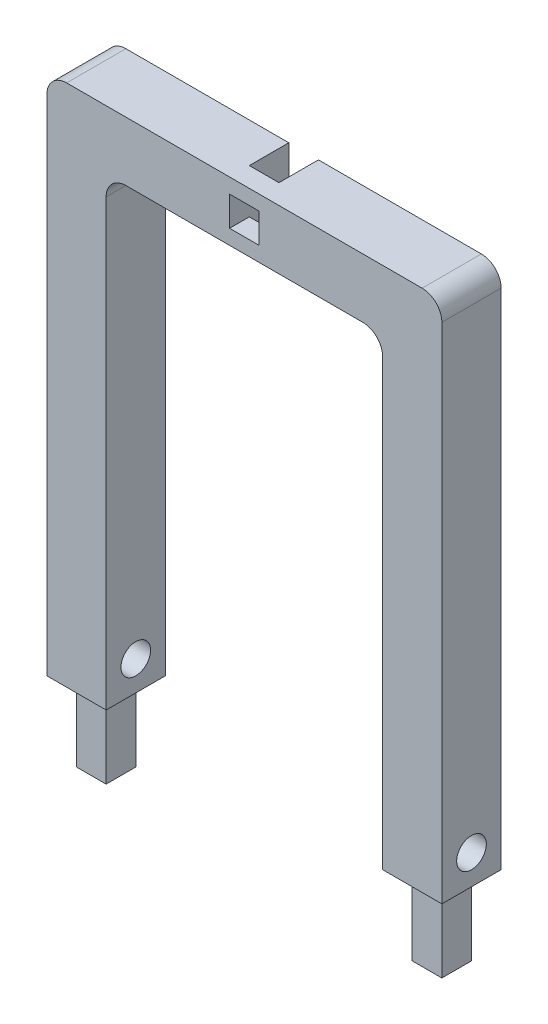
ISO-10303-21;
HEADER;
FILE_DESCRIPTION(('STEP AP214'),'2;1');
FILE_NAME('part.step','',(''),(''),'','','');
FILE_SCHEMA(('AUTOMOTIVE_DESIGN { 1 0 10303 214 1 1 1 1 }'));
ENDSEC;
DATA;
#1=APPLICATION_CONTEXT('core data for automotive mechanical design processes');
#2=APPLICATION_PROTOCOL_DEFINITION('international standard','automotive_design',2000,#1);
#3=PRODUCT_CONTEXT('',#1,'mechanical');
#4=PRODUCT('Part','Part','',(#3));
#5=PRODUCT_RELATED_PRODUCT_CATEGORY('part','',(#4));
#6=PRODUCT_DEFINITION_FORMATION('','',#4);
#7=PRODUCT_DEFINITION_CONTEXT('part definition',#1,'design');
#8=PRODUCT_DEFINITION('design','',#6,#7);
#9=PRODUCT_DEFINITION_SHAPE('','',#8);
#10=(LENGTH_UNIT() NAMED_UNIT(*) SI_UNIT(.MILLI.,.METRE.));
#11=(NAMED_UNIT(*) PLANE_ANGLE_UNIT() SI_UNIT($,.RADIAN.));
#12=(NAMED_UNIT(*) SI_UNIT($,.STERADIAN.) SOLID_ANGLE_UNIT());
#13=UNCERTAINTY_MEASURE_WITH_UNIT(LENGTH_MEASURE(1.E-05),#10,'distance_accuracy_value','');
#14=(GEOMETRIC_REPRESENTATION_CONTEXT(3) GLOBAL_UNCERTAINTY_ASSIGNED_CONTEXT((#13)) GLOBAL_UNIT_ASSIGNED_CONTEXT((#10,
#11,#12)) REPRESENTATION_CONTEXT('',''));
#15=CARTESIAN_POINT('',(0.,0.,0.));
#16=DIRECTION('',(0.,0.,1.));
#17=DIRECTION('',(1.,0.,0.));
#18=AXIS2_PLACEMENT_3D('',#15,#16,#17);
#19=CARTESIAN_POINT('',(0.,0.,19.9999999999999));
#20=DIRECTION('',(0.,0.,1.));
#21=DIRECTION('',(1.,0.,0.));
#22=AXIS2_PLACEMENT_3D('',#19,#20,#21);
#23=PLANE('',#22);
#24=DIRECTION('',(0.,-1.,0.));
#25=VECTOR('',#24,1.);
#26=CARTESIAN_POINT('',(-0.430867489218175,147.118199142858,19.9999999999999));
#27=LINE('',#26,#25);
#28=CARTESIAN_POINT('',(-0.43086748921817,177.118199142858,19.9999999999999));
#29=VERTEX_POINT('',#28);
#30=CARTESIAN_POINT('',(-0.43086748921817,169.618199142858,20.));
#31=VERTEX_POINT('',#30);
#32=EDGE_CURVE('E474',#29,#31,#27,.T.);
#33=ORIENTED_EDGE('',*,*,#32,.T.);
#34=DIRECTION('',(-1.,0.,0.));
#35=VECTOR('',#34,1.);
#36=CARTESIAN_POINT('',(-15.4308674892182,169.618199142858,20.));
#37=LINE('',#36,#35);
#38=CARTESIAN_POINT('',(-15.4308674892182,169.618199142858,20.));
#39=VERTEX_POINT('',#38);
#40=EDGE_CURVE('E229',#31,#39,#37,.T.);
#41=ORIENTED_EDGE('',*,*,#40,.T.);
#42=DIRECTION('',(0.,1.,0.));
#43=VECTOR('',#42,1.);
#44=CARTESIAN_POINT('',(-15.4308674892182,147.118199142858,19.9999999999999));
#45=LINE('',#44,#43);
#46=CARTESIAN_POINT('',(-15.4308674892182,177.118199142858,19.9999999999999));
#47=VERTEX_POINT('',#46);
#48=EDGE_CURVE('E242',#39,#47,#45,.T.);
#49=ORIENTED_EDGE('',*,*,#48,.T.);
#50=DIRECTION('',(1.,0.,0.));
#51=VECTOR('',#50,1.);
#52=CARTESIAN_POINT('',(-0.43086748921817,177.118199142858,19.9999999999999));
#53=LINE('',#52,#51);
#54=EDGE_CURVE('E241',#47,#29,#53,.T.);
#55=ORIENTED_EDGE('',*,*,#54,.T.);
#56=EDGE_LOOP('',(#33,#41,#49,#55));
#57=FACE_BOUND('',#56,.T.);
#58=ADVANCED_FACE('F41',(#57),#23,.F.);
#59=CARTESIAN_POINT('',(0.,0.,0.));
#60=DIRECTION('',(0.,0.,-1.));
#61=DIRECTION('',(-1.,0.,0.));
#62=AXIS2_PLACEMENT_3D('',#59,#60,#61);
#63=PLANE('',#62);
#64=DIRECTION('',(0.,-1.,0.));
#65=VECTOR('',#64,1.);
#66=CARTESIAN_POINT('',(-0.430867489218175,147.118199142858,0.));
#67=LINE('',#66,#65);
#68=CARTESIAN_POINT('',(-0.43086748921817,177.118199142858,0.));
#69=VERTEX_POINT('',#68);
#70=CARTESIAN_POINT('',(-0.430867489218175,147.118199142858,0.));
#71=VERTEX_POINT('',#70);
#72=EDGE_CURVE('E250',#69,#71,#67,.T.);
#73=ORIENTED_EDGE('',*,*,#72,.F.);
#74=DIRECTION('',(-1.,0.,0.));
#75=VECTOR('',#74,1.);
#76=CARTESIAN_POINT('',(-107.931034482759,177.118199142858,0.));
#77=LINE('',#76,#75);
#78=CARTESIAN_POINT('',(82.0689655172413,177.118199142858,0.));
#79=VERTEX_POINT('',#78);
#80=EDGE_CURVE('E347',#79,#69,#77,.T.);
#81=ORIENTED_EDGE('',*,*,#80,.F.);
#82=CARTESIAN_POINT('',(82.0689655172413,167.118199142858,0.));
#83=DIRECTION('',(0.,0.,-1.));
#84=DIRECTION('',(-1.,0.,0.));
#85=AXIS2_PLACEMENT_3D('',#82,#83,#84);
#86=CIRCLE('',#85,10.);
#87=CARTESIAN_POINT('',(92.0689655172413,167.118199142858,0.));
#88=VERTEX_POINT('',#87);
#89=EDGE_CURVE('E419',#79,#88,#86,.T.);
#90=ORIENTED_EDGE('',*,*,#89,.T.);
#91=DIRECTION('',(0.,1.,0.));
#92=VECTOR('',#91,1.);
#93=CARTESIAN_POINT('',(92.0689655172413,177.118199142858,0.));
#94=LINE('',#93,#92);
#95=CARTESIAN_POINT('',(92.0689655172414,-87.8818008571423,0.));
#96=VERTEX_POINT('',#95);
#97=EDGE_CURVE('E380',#96,#88,#94,.T.);
#98=ORIENTED_EDGE('',*,*,#97,.F.);
#99=DIRECTION('',(1.,0.,0.));
#100=VECTOR('',#99,1.);
#101=CARTESIAN_POINT('',(92.0689655172414,-87.8818008571423,0.));
#102=LINE('',#101,#100);
#103=CARTESIAN_POINT('',(62.0689655172414,-87.8818008571423,0.));
#104=VERTEX_POINT('',#103);
#105=EDGE_CURVE('E378',#104,#96,#102,.T.);
#106=ORIENTED_EDGE('',*,*,#105,.F.);
#107=DIRECTION('',(0.,-1.,0.));
#108=VECTOR('',#107,1.);
#109=CARTESIAN_POINT('',(62.0689655172414,-87.8818008571423,0.));
#110=LINE('',#109,#108);
#111=CARTESIAN_POINT('',(62.0689655172414,137.118199142858,0.));
#112=VERTEX_POINT('',#111);
#113=EDGE_CURVE('E376',#112,#104,#110,.T.);
#114=ORIENTED_EDGE('',*,*,#113,.F.);
#115=CARTESIAN_POINT('',(52.0689655172414,137.118199142858,0.));
#116=DIRECTION('',(0.,0.,-1.));
#117=DIRECTION('',(-1.,0.,0.));
#118=AXIS2_PLACEMENT_3D('',#115,#116,#117);
#119=CIRCLE('',#118,10.);
#120=CARTESIAN_POINT('',(52.0689655172414,147.118199142858,0.));
#121=VERTEX_POINT('',#120);
#122=EDGE_CURVE('E407',#112,#121,#119,.F.);
#123=ORIENTED_EDGE('',*,*,#122,.T.);
#124=DIRECTION('',(1.,0.,0.));
#125=VECTOR('',#124,1.);
#126=CARTESIAN_POINT('',(62.0689655172414,147.118199142858,0.));
#127=LINE('',#126,#125);
#128=EDGE_CURVE('E372',#71,#121,#127,.T.);
#129=ORIENTED_EDGE('',*,*,#128,.F.);
#130=EDGE_LOOP('',(#73,#81,#90,#98,#106,#114,#123,#129));
#131=FACE_BOUND('',#130,.T.);
#132=ADVANCED_FACE('F500',(#131),#63,.T.);
#133=CARTESIAN_POINT('',(-77.9310344827586,-87.8818008571423,30.));
#134=DIRECTION('',(0.,1.,0.));
#135=DIRECTION('',(0.,0.,1.));
#136=AXIS2_PLACEMENT_3D('',#133,#134,#135);
#137=PLANE('',#136);
#138=DIRECTION('',(1.,0.,0.));
#139=VECTOR('',#138,1.);
#140=CARTESIAN_POINT('',(-77.9310344827586,-87.8818008571423,0.));
#141=LINE('',#140,#139);
#142=CARTESIAN_POINT('',(-107.931034482759,-87.8818008571423,0.));
#143=VERTEX_POINT('',#142);
#144=CARTESIAN_POINT('',(-77.9310344827586,-87.8818008571423,0.));
#145=VERTEX_POINT('',#144);
#146=EDGE_CURVE('E367',#143,#145,#141,.T.);
#147=ORIENTED_EDGE('',*,*,#146,.T.);
#148=DIRECTION('',(0.,0.,-1.));
#149=VECTOR('',#148,1.);
#150=CARTESIAN_POINT('',(-77.9310344827586,-87.8818008571423,30.));
#151=LINE('',#150,#149);
#152=CARTESIAN_POINT('',(-77.9310344827586,-87.8818008571423,30.));
#153=VERTEX_POINT('',#152);
#154=EDGE_CURVE('E391',#153,#145,#151,.T.);
#155=ORIENTED_EDGE('',*,*,#154,.F.);
#156=DIRECTION('',(1.,0.,0.));
#157=VECTOR('',#156,1.);
#158=CARTESIAN_POINT('',(-77.9310344827586,-87.8818008571423,30.));
#159=LINE('',#158,#157);
#160=CARTESIAN_POINT('',(-107.931034482759,-87.8818008571423,30.));
#161=VERTEX_POINT('',#160);
#162=EDGE_CURVE('E346',#161,#153,#159,.T.);
#163=ORIENTED_EDGE('',*,*,#162,.F.);
#164=DIRECTION('',(0.,0.,-1.));
#165=VECTOR('',#164,1.);
#166=CARTESIAN_POINT('',(-107.931034482759,-87.8818008571423,30.));
#167=LINE('',#166,#165);
#168=EDGE_CURVE('E394',#161,#143,#167,.T.);
#169=ORIENTED_EDGE('',*,*,#168,.T.);
#170=EDGE_LOOP('',(#147,#155,#163,#169));
#171=FACE_BOUND('',#170,.T.);
#172=DIRECTION('',(0.,0.,1.));
#173=VECTOR('',#172,1.);
#174=CARTESIAN_POINT('',(-85.4310344827586,-87.8818008571424,22.5));
#175=LINE('',#174,#173);
#176=CARTESIAN_POINT('',(-85.4310344827586,-87.8818008571424,7.5));
#177=VERTEX_POINT('',#176);
#178=CARTESIAN_POINT('',(-85.4310344827586,-87.8818008571423,22.5));
#179=VERTEX_POINT('',#178);
#180=EDGE_CURVE('E277',#177,#179,#175,.T.);
#181=ORIENTED_EDGE('',*,*,#180,.F.);
#182=DIRECTION('',(1.,0.,0.));
#183=VECTOR('',#182,1.);
#184=CARTESIAN_POINT('',(-100.431034482759,-87.8818008571424,7.5));
#185=LINE('',#184,#183);
#186=CARTESIAN_POINT('',(-100.431034482759,-87.8818008571423,7.5));
#187=VERTEX_POINT('',#186);
#188=EDGE_CURVE('E282',#187,#177,#185,.T.);
#189=ORIENTED_EDGE('',*,*,#188,.F.);
#190=DIRECTION('',(0.,0.,-1.));
#191=VECTOR('',#190,1.);
#192=CARTESIAN_POINT('',(-100.431034482759,-87.8818008571424,22.5));
#193=LINE('',#192,#191);
#194=CARTESIAN_POINT('',(-100.431034482759,-87.8818008571423,22.5));
#195=VERTEX_POINT('',#194);
#196=EDGE_CURVE('E294',#195,#187,#193,.T.);
#197=ORIENTED_EDGE('',*,*,#196,.F.);
#198=DIRECTION('',(-1.,0.,0.));
#199=VECTOR('',#198,1.);
#200=CARTESIAN_POINT('',(-100.431034482759,-87.8818008571424,22.5));
#201=LINE('',#200,#199);
#202=EDGE_CURVE('E291',#179,#195,#201,.T.);
#203=ORIENTED_EDGE('',*,*,#202,.F.);
#204=EDGE_LOOP('',(#181,#189,#197,#203));
#205=FACE_BOUND('',#204,.T.);
#206=ADVANCED_FACE('F452',(#171,#205),#137,.F.);
#207=CARTESIAN_POINT('',(92.0689655172414,-87.8818008571423,30.));
#208=DIRECTION('',(0.,1.,0.));
#209=DIRECTION('',(-1.,0.,0.));
#210=AXIS2_PLACEMENT_3D('',#207,#208,#209);
#211=PLANE('',#210);
#212=ORIENTED_EDGE('',*,*,#105,.T.);
#213=DIRECTION('',(0.,0.,-1.));
#214=VECTOR('',#213,1.);
#215=CARTESIAN_POINT('',(92.0689655172414,-87.8818008571423,30.));
#216=LINE('',#215,#214);
#217=CARTESIAN_POINT('',(92.0689655172414,-87.8818008571423,30.));
#218=VERTEX_POINT('',#217);
#219=EDGE_CURVE('E365',#218,#96,#216,.T.);
#220=ORIENTED_EDGE('',*,*,#219,.F.);
#221=DIRECTION('',(1.,0.,0.));
#222=VECTOR('',#221,1.);
#223=CARTESIAN_POINT('',(92.0689655172414,-87.8818008571423,30.));
#224=LINE('',#223,#222);
#225=CARTESIAN_POINT('',(62.0689655172414,-87.8818008571423,30.));
#226=VERTEX_POINT('',#225);
#227=EDGE_CURVE('E357',#226,#218,#224,.T.);
#228=ORIENTED_EDGE('',*,*,#227,.F.);
#229=DIRECTION('',(0.,0.,-1.));
#230=VECTOR('',#229,1.);
#231=CARTESIAN_POINT('',(62.0689655172414,-87.8818008571423,30.));
#232=LINE('',#231,#230);
#233=EDGE_CURVE('E388',#226,#104,#232,.T.);
#234=ORIENTED_EDGE('',*,*,#233,.T.);
#235=EDGE_LOOP('',(#212,#220,#228,#234));
#236=FACE_BOUND('',#235,.T.);
#237=DIRECTION('',(0.,0.,1.));
#238=VECTOR('',#237,1.);
#239=CARTESIAN_POINT('',(84.5689655172413,-87.8818008571423,22.5));
#240=LINE('',#239,#238);
#241=CARTESIAN_POINT('',(84.5689655172413,-87.8818008571423,7.5));
#242=VERTEX_POINT('',#241);
#243=CARTESIAN_POINT('',(84.5689655172414,-87.8818008571423,22.5));
#244=VERTEX_POINT('',#243);
#245=EDGE_CURVE('E310',#242,#244,#240,.T.);
#246=ORIENTED_EDGE('',*,*,#245,.F.);
#247=DIRECTION('',(1.,0.,0.));
#248=VECTOR('',#247,1.);
#249=CARTESIAN_POINT('',(69.5689655172413,-87.8818008571423,7.5));
#250=LINE('',#249,#248);
#251=CARTESIAN_POINT('',(69.5689655172413,-87.8818008571423,7.5));
#252=VERTEX_POINT('',#251);
#253=EDGE_CURVE('E315',#252,#242,#250,.T.);
#254=ORIENTED_EDGE('',*,*,#253,.F.);
#255=DIRECTION('',(0.,0.,-1.));
#256=VECTOR('',#255,1.);
#257=CARTESIAN_POINT('',(69.5689655172413,-87.8818008571423,22.5));
#258=LINE('',#257,#256);
#259=CARTESIAN_POINT('',(69.5689655172413,-87.8818008571423,22.5));
#260=VERTEX_POINT('',#259);
#261=EDGE_CURVE('E327',#260,#252,#258,.T.);
#262=ORIENTED_EDGE('',*,*,#261,.F.);
#263=DIRECTION('',(-1.,0.,0.));
#264=VECTOR('',#263,1.);
#265=CARTESIAN_POINT('',(69.5689655172413,-87.8818008571423,22.5));
#266=LINE('',#265,#264);
#267=EDGE_CURVE('E324',#244,#260,#266,.T.);
#268=ORIENTED_EDGE('',*,*,#267,.F.);
#269=EDGE_LOOP('',(#246,#254,#262,#268));
#270=FACE_BOUND('',#269,.T.);
#271=ADVANCED_FACE('F516',(#236,#270),#211,.F.);
#272=CARTESIAN_POINT('',(-107.931034482759,-87.8818008571423,30.));
#273=DIRECTION('',(1.,0.,0.));
#274=DIRECTION('',(0.,0.,-1.));
#275=AXIS2_PLACEMENT_3D('',#272,#273,#274);
#276=PLANE('',#275);
#277=CARTESIAN_POINT('',(-107.931034482759,-72.8818008571423,15.));
#278=DIRECTION('',(1.,0.,0.));
#279=DIRECTION('',(0.,1.,0.));
#280=AXIS2_PLACEMENT_3D('',#277,#278,#279);
#281=CIRCLE('',#280,7.50000000000001);
#282=CARTESIAN_POINT('',(-107.931034482759,-65.3818008571423,15.));
#283=VERTEX_POINT('',#282);
#284=EDGE_CURVE('E268',#283,#283,#281,.T.);
#285=ORIENTED_EDGE('',*,*,#284,.T.);
#286=EDGE_LOOP('',(#285));
#287=FACE_BOUND('',#286,.T.);
#288=DIRECTION('',(0.,-1.,0.));
#289=VECTOR('',#288,1.);
#290=CARTESIAN_POINT('',(-107.931034482759,-87.8818008571423,30.));
#291=LINE('',#290,#289);
#292=CARTESIAN_POINT('',(-107.931034482759,167.118199142858,30.));
#293=VERTEX_POINT('',#292);
#294=EDGE_CURVE('E344',#293,#161,#291,.T.);
#295=ORIENTED_EDGE('',*,*,#294,.F.);
#296=DIRECTION('',(0.,0.,-1.));
#297=VECTOR('',#296,1.);
#298=CARTESIAN_POINT('',(-107.931034482759,167.118199142858,30.));
#299=LINE('',#298,#297);
#300=CARTESIAN_POINT('',(-107.931034482759,167.118199142858,0.));
#301=VERTEX_POINT('',#300);
#302=EDGE_CURVE('E416',#293,#301,#299,.T.);
#303=ORIENTED_EDGE('',*,*,#302,.T.);
#304=DIRECTION('',(0.,-1.,0.));
#305=VECTOR('',#304,1.);
#306=CARTESIAN_POINT('',(-107.931034482759,-87.8818008571423,0.));
#307=LINE('',#306,#305);
#308=EDGE_CURVE('E343',#301,#143,#307,.T.);
#309=ORIENTED_EDGE('',*,*,#308,.T.);
#310=ORIENTED_EDGE('',*,*,#168,.F.);
#311=EDGE_LOOP('',(#295,#303,#309,#310));
#312=FACE_BOUND('',#311,.T.);
#313=ADVANCED_FACE('F441',(#287,#312),#276,.F.);
#314=CARTESIAN_POINT('',(-77.9310344827587,147.118199142858,30.));
#315=DIRECTION('',(-1.,0.,0.));
#316=DIRECTION('',(0.,-1.,0.));
#317=AXIS2_PLACEMENT_3D('',#314,#315,#316);
#318=PLANE('',#317);
#319=CARTESIAN_POINT('',(-77.9310344827586,-72.8818008571423,15.));
#320=DIRECTION('',(-1.,0.,0.));
#321=DIRECTION('',(0.,-1.,0.));
#322=AXIS2_PLACEMENT_3D('',#319,#320,#321);
#323=CIRCLE('',#322,7.50000000000001);
#324=CARTESIAN_POINT('',(-77.9310344827586,-80.3818008571423,15.));
#325=VERTEX_POINT('',#324);
#326=EDGE_CURVE('E274',#325,#325,#323,.T.);
#327=ORIENTED_EDGE('',*,*,#326,.T.);
#328=EDGE_LOOP('',(#327));
#329=FACE_BOUND('',#328,.T.);
#330=DIRECTION('',(0.,1.,0.));
#331=VECTOR('',#330,1.);
#332=CARTESIAN_POINT('',(-77.9310344827587,147.118199142858,0.));
#333=LINE('',#332,#331);
#334=CARTESIAN_POINT('',(-77.9310344827587,137.118199142858,0.));
#335=VERTEX_POINT('',#334);
#336=EDGE_CURVE('E369',#145,#335,#333,.T.);
#337=ORIENTED_EDGE('',*,*,#336,.T.);
#338=DIRECTION('',(0.,0.,-1.));
#339=VECTOR('',#338,1.);
#340=CARTESIAN_POINT('',(-77.9310344827587,137.118199142858,30.));
#341=LINE('',#340,#339);
#342=CARTESIAN_POINT('',(-77.9310344827587,137.118199142858,30.));
#343=VERTEX_POINT('',#342);
#344=EDGE_CURVE('E405',#335,#343,#341,.F.);
#345=ORIENTED_EDGE('',*,*,#344,.T.);
#346=DIRECTION('',(0.,1.,0.));
#347=VECTOR('',#346,1.);
#348=CARTESIAN_POINT('',(-77.9310344827587,147.118199142858,30.));
#349=LINE('',#348,#347);
#350=EDGE_CURVE('E349',#153,#343,#349,.T.);
#351=ORIENTED_EDGE('',*,*,#350,.F.);
#352=ORIENTED_EDGE('',*,*,#154,.T.);
#353=EDGE_LOOP('',(#337,#345,#351,#352));
#354=FACE_BOUND('',#353,.T.);
#355=ADVANCED_FACE('F739',(#329,#354),#318,.F.);
#356=CARTESIAN_POINT('',(62.0689655172414,147.118199142858,30.));
#357=DIRECTION('',(0.,1.,0.));
#358=DIRECTION('',(0.,0.,1.));
#359=AXIS2_PLACEMENT_3D('',#356,#357,#358);
#360=PLANE('',#359);
#361=DIRECTION('',(-1.,0.,0.));
#362=VECTOR('',#361,1.);
#363=CARTESIAN_POINT('',(-0.430867489218175,147.118199142858,19.9999999999999));
#364=LINE('',#363,#362);
#365=CARTESIAN_POINT('',(-0.430867489218175,147.118199142858,19.9999999999999));
#366=VERTEX_POINT('',#365);
#367=CARTESIAN_POINT('',(-15.4308674892182,147.118199142858,19.9999999999999));
#368=VERTEX_POINT('',#367);
#369=EDGE_CURVE('E239',#366,#368,#364,.T.);
#370=ORIENTED_EDGE('',*,*,#369,.F.);
#371=DIRECTION('',(0.,0.,-1.));
#372=VECTOR('',#371,1.);
#373=CARTESIAN_POINT('',(-0.430867489218175,147.118199142858,19.9999999999999));
#374=LINE('',#373,#372);
#375=EDGE_CURVE('E245',#366,#71,#374,.T.);
#376=ORIENTED_EDGE('',*,*,#375,.T.);
#377=ORIENTED_EDGE('',*,*,#128,.T.);
#378=DIRECTION('',(0.,0.,-1.));
#379=VECTOR('',#378,1.);
#380=CARTESIAN_POINT('',(52.0689655172414,147.118199142858,30.));
#381=LINE('',#380,#379);
#382=CARTESIAN_POINT('',(52.0689655172414,147.118199142858,30.));
#383=VERTEX_POINT('',#382);
#384=EDGE_CURVE('E403',#121,#383,#381,.F.);
#385=ORIENTED_EDGE('',*,*,#384,.T.);
#386=DIRECTION('',(1.,0.,0.));
#387=VECTOR('',#386,1.);
#388=CARTESIAN_POINT('',(62.0689655172414,147.118199142858,30.));
#389=LINE('',#388,#387);
#390=CARTESIAN_POINT('',(-67.9310344827586,147.118199142858,30.));
#391=VERTEX_POINT('',#390);
#392=EDGE_CURVE('E352',#391,#383,#389,.T.);
#393=ORIENTED_EDGE('',*,*,#392,.F.);
#394=DIRECTION('',(0.,0.,-1.));
#395=VECTOR('',#394,1.);
#396=CARTESIAN_POINT('',(-67.9310344827586,147.118199142858,0.));
#397=LINE('',#396,#395);
#398=CARTESIAN_POINT('',(-67.9310344827586,147.118199142858,0.));
#399=VERTEX_POINT('',#398);
#400=EDGE_CURVE('E400',#391,#399,#397,.T.);
#401=ORIENTED_EDGE('',*,*,#400,.T.);
#402=CARTESIAN_POINT('',(-15.4308674892182,147.118199142858,0.));
#403=VERTEX_POINT('',#402);
#404=EDGE_CURVE('E373',#399,#403,#127,.T.);
#405=ORIENTED_EDGE('',*,*,#404,.T.);
#406=DIRECTION('',(0.,0.,-1.));
#407=VECTOR('',#406,1.);
#408=CARTESIAN_POINT('',(-15.4308674892182,147.118199142858,19.9999999999999));
#409=LINE('',#408,#407);
#410=EDGE_CURVE('E262',#368,#403,#409,.T.);
#411=ORIENTED_EDGE('',*,*,#410,.F.);
#412=EDGE_LOOP('',(#370,#376,#377,#385,#393,#401,#405,#411));
#413=FACE_BOUND('',#412,.T.);
#414=ADVANCED_FACE('F464',(#413),#360,.F.);
#415=CARTESIAN_POINT('',(62.0689655172414,-87.8818008571423,30.));
#416=DIRECTION('',(1.,0.,0.));
#417=DIRECTION('',(0.,0.,-1.));
#418=AXIS2_PLACEMENT_3D('',#415,#416,#417);
#419=PLANE('',#418);
#420=CARTESIAN_POINT('',(62.0689655172413,-72.8818008571423,15.));
#421=DIRECTION('',(1.,0.,0.));
#422=DIRECTION('',(0.,0.,-1.));
#423=AXIS2_PLACEMENT_3D('',#420,#421,#422);
#424=CIRCLE('',#423,7.50000000000001);
#425=CARTESIAN_POINT('',(62.0689655172413,-72.8818008571423,7.49999999999999));
#426=VERTEX_POINT('',#425);
#427=EDGE_CURVE('E271',#426,#426,#424,.T.);
#428=ORIENTED_EDGE('',*,*,#427,.T.);
#429=EDGE_LOOP('',(#428));
#430=FACE_BOUND('',#429,.T.);
#431=DIRECTION('',(0.,-1.,0.));
#432=VECTOR('',#431,1.);
#433=CARTESIAN_POINT('',(62.0689655172414,-87.8818008571423,30.));
#434=LINE('',#433,#432);
#435=CARTESIAN_POINT('',(62.0689655172414,137.118199142858,30.));
#436=VERTEX_POINT('',#435);
#437=EDGE_CURVE('E355',#436,#226,#434,.T.);
#438=ORIENTED_EDGE('',*,*,#437,.F.);
#439=DIRECTION('',(0.,0.,-1.));
#440=VECTOR('',#439,1.);
#441=CARTESIAN_POINT('',(62.0689655172414,137.118199142858,0.));
#442=LINE('',#441,#440);
#443=EDGE_CURVE('E397',#436,#112,#442,.T.);
#444=ORIENTED_EDGE('',*,*,#443,.T.);
#445=ORIENTED_EDGE('',*,*,#113,.T.);
#446=ORIENTED_EDGE('',*,*,#233,.F.);
#447=EDGE_LOOP('',(#438,#444,#445,#446));
#448=FACE_BOUND('',#447,.T.);
#449=ADVANCED_FACE('F512',(#430,#448),#419,.F.);
#450=CARTESIAN_POINT('',(92.0689655172413,177.118199142858,30.));
#451=DIRECTION('',(-1.,0.,0.));
#452=DIRECTION('',(0.,-1.,0.));
#453=AXIS2_PLACEMENT_3D('',#450,#451,#452);
#454=PLANE('',#453);
#455=CARTESIAN_POINT('',(92.0689655172414,-72.8818008571423,15.));
#456=DIRECTION('',(1.,0.,0.));
#457=DIRECTION('',(0.,1.,0.));
#458=AXIS2_PLACEMENT_3D('',#455,#456,#457);
#459=CIRCLE('',#458,7.50000000000001);
#460=CARTESIAN_POINT('',(92.0689655172414,-65.3818008571423,15.));
#461=VERTEX_POINT('',#460);
#462=EDGE_CURVE('E258',#461,#461,#459,.T.);
#463=ORIENTED_EDGE('',*,*,#462,.F.);
#464=EDGE_LOOP('',(#463));
#465=FACE_BOUND('',#464,.T.);
#466=ORIENTED_EDGE('',*,*,#97,.T.);
#467=DIRECTION('',(0.,0.,-1.));
#468=VECTOR('',#467,1.);
#469=CARTESIAN_POINT('',(92.0689655172413,167.118199142858,30.));
#470=LINE('',#469,#468);
#471=CARTESIAN_POINT('',(92.0689655172413,167.118199142858,30.));
#472=VERTEX_POINT('',#471);
#473=EDGE_CURVE('E11',#88,#472,#470,.F.);
#474=ORIENTED_EDGE('',*,*,#473,.T.);
#475=DIRECTION('',(0.,1.,0.));
#476=VECTOR('',#475,1.);
#477=CARTESIAN_POINT('',(92.0689655172413,177.118199142858,30.));
#478=LINE('',#477,#476);
#479=EDGE_CURVE('E359',#218,#472,#478,.T.);
#480=ORIENTED_EDGE('',*,*,#479,.F.);
#481=ORIENTED_EDGE('',*,*,#219,.T.);
#482=EDGE_LOOP('',(#466,#474,#480,#481));
#483=FACE_BOUND('',#482,.T.);
#484=ADVANCED_FACE('F525',(#465,#483),#454,.F.);
#485=CARTESIAN_POINT('',(-107.931034482759,177.118199142858,30.));
#486=DIRECTION('',(0.,-1.,0.));
#487=DIRECTION('',(0.,0.,-1.));
#488=AXIS2_PLACEMENT_3D('',#485,#486,#487);
#489=PLANE('',#488);
#490=ORIENTED_EDGE('',*,*,#80,.T.);
#491=DIRECTION('',(0.,0.,-1.));
#492=VECTOR('',#491,1.);
#493=CARTESIAN_POINT('',(-0.43086748921817,177.118199142858,19.9999999999999));
#494=LINE('',#493,#492);
#495=EDGE_CURVE('E256',#29,#69,#494,.T.);
#496=ORIENTED_EDGE('',*,*,#495,.F.);
#497=ORIENTED_EDGE('',*,*,#54,.F.);
#498=DIRECTION('',(0.,0.,-1.));
#499=VECTOR('',#498,1.);
#500=CARTESIAN_POINT('',(-15.4308674892182,177.118199142858,19.9999999999999));
#501=LINE('',#500,#499);
#502=CARTESIAN_POINT('',(-15.4308674892182,177.118199142858,0.));
#503=VERTEX_POINT('',#502);
#504=EDGE_CURVE('E259',#47,#503,#501,.T.);
#505=ORIENTED_EDGE('',*,*,#504,.T.);
#506=CARTESIAN_POINT('',(-97.9310344827586,177.118199142858,0.));
#507=VERTEX_POINT('',#506);
#508=EDGE_CURVE('E383',#503,#507,#77,.T.);
#509=ORIENTED_EDGE('',*,*,#508,.T.);
#510=DIRECTION('',(0.,0.,-1.));
#511=VECTOR('',#510,1.);
#512=CARTESIAN_POINT('',(-97.9310344827586,177.118199142858,30.));
#513=LINE('',#512,#511);
#514=CARTESIAN_POINT('',(-97.9310344827586,177.118199142858,30.));
#515=VERTEX_POINT('',#514);
#516=EDGE_CURVE('E427',#507,#515,#513,.F.);
#517=ORIENTED_EDGE('',*,*,#516,.T.);
#518=DIRECTION('',(-1.,0.,0.));
#519=VECTOR('',#518,1.);
#520=CARTESIAN_POINT('',(-107.931034482759,177.118199142858,30.));
#521=LINE('',#520,#519);
#522=CARTESIAN_POINT('',(82.0689655172413,177.118199142858,30.));
#523=VERTEX_POINT('',#522);
#524=EDGE_CURVE('E362',#523,#515,#521,.T.);
#525=ORIENTED_EDGE('',*,*,#524,.F.);
#526=DIRECTION('',(0.,0.,-1.));
#527=VECTOR('',#526,1.);
#528=CARTESIAN_POINT('',(82.0689655172413,177.118199142858,30.));
#529=LINE('',#528,#527);
#530=EDGE_CURVE('E424',#523,#79,#529,.T.);
#531=ORIENTED_EDGE('',*,*,#530,.T.);
#532=EDGE_LOOP('',(#490,#496,#497,#505,#509,#517,#525,#531));
#533=FACE_BOUND('',#532,.T.);
#534=ADVANCED_FACE('F469',(#533),#489,.F.);
#535=CARTESIAN_POINT('',(0.,0.,30.));
#536=DIRECTION('',(0.,0.,-1.));
#537=DIRECTION('',(-1.,0.,0.));
#538=AXIS2_PLACEMENT_3D('',#535,#536,#537);
#539=PLANE('',#538);
#540=DIRECTION('',(1.,0.,0.));
#541=VECTOR('',#540,1.);
#542=CARTESIAN_POINT('',(-15.4308674892182,154.618199142858,30.));
#543=LINE('',#542,#541);
#544=CARTESIAN_POINT('',(-15.4308674892182,154.618199142858,30.));
#545=VERTEX_POINT('',#544);
#546=CARTESIAN_POINT('',(-0.43086748921817,154.618199142858,30.));
#547=VERTEX_POINT('',#546);
#548=EDGE_CURVE('E487',#545,#547,#543,.T.);
#549=ORIENTED_EDGE('',*,*,#548,.F.);
#550=DIRECTION('',(0.,-1.,0.));
#551=VECTOR('',#550,1.);
#552=CARTESIAN_POINT('',(-15.4308674892182,169.618199142858,30.));
#553=LINE('',#552,#551);
#554=CARTESIAN_POINT('',(-15.4308674892182,169.618199142858,30.));
#555=VERTEX_POINT('',#554);
#556=EDGE_CURVE('E56',#555,#545,#553,.T.);
#557=ORIENTED_EDGE('',*,*,#556,.F.);
#558=DIRECTION('',(-1.,0.,0.));
#559=VECTOR('',#558,1.);
#560=CARTESIAN_POINT('',(-15.4308674892182,169.618199142858,30.));
#561=LINE('',#560,#559);
#562=CARTESIAN_POINT('',(-0.43086748921817,169.618199142858,30.));
#563=VERTEX_POINT('',#562);
#564=EDGE_CURVE('E235',#563,#555,#561,.T.);
#565=ORIENTED_EDGE('',*,*,#564,.F.);
#566=DIRECTION('',(0.,1.,0.));
#567=VECTOR('',#566,1.);
#568=CARTESIAN_POINT('',(-0.43086748921817,169.618199142858,30.));
#569=LINE('',#568,#567);
#570=EDGE_CURVE('E485',#547,#563,#569,.T.);
#571=ORIENTED_EDGE('',*,*,#570,.F.);
#572=EDGE_LOOP('',(#549,#557,#565,#571));
#573=FACE_BOUND('',#572,.T.);
#574=ORIENTED_EDGE('',*,*,#524,.T.);
#575=CARTESIAN_POINT('',(-97.9310344827586,167.118199142858,30.));
#576=DIRECTION('',(0.,0.,-1.));
#577=DIRECTION('',(-1.,0.,0.));
#578=AXIS2_PLACEMENT_3D('',#575,#576,#577);
#579=CIRCLE('',#578,10.);
#580=EDGE_CURVE('E49',#515,#293,#579,.F.);
#581=ORIENTED_EDGE('',*,*,#580,.T.);
#582=ORIENTED_EDGE('',*,*,#294,.T.);
#583=ORIENTED_EDGE('',*,*,#162,.T.);
#584=ORIENTED_EDGE('',*,*,#350,.T.);
#585=CARTESIAN_POINT('',(-67.9310344827586,137.118199142858,30.));
#586=DIRECTION('',(0.,0.,-1.));
#587=DIRECTION('',(-1.,0.,0.));
#588=AXIS2_PLACEMENT_3D('',#585,#586,#587);
#589=CIRCLE('',#588,10.);
#590=EDGE_CURVE('E414',#343,#391,#589,.T.);
#591=ORIENTED_EDGE('',*,*,#590,.T.);
#592=ORIENTED_EDGE('',*,*,#392,.T.);
#593=CARTESIAN_POINT('',(52.0689655172414,137.118199142858,30.));
#594=DIRECTION('',(0.,0.,-1.));
#595=DIRECTION('',(-1.,0.,0.));
#596=AXIS2_PLACEMENT_3D('',#593,#594,#595);
#597=CIRCLE('',#596,10.);
#598=EDGE_CURVE('E410',#383,#436,#597,.T.);
#599=ORIENTED_EDGE('',*,*,#598,.T.);
#600=ORIENTED_EDGE('',*,*,#437,.T.);
#601=ORIENTED_EDGE('',*,*,#227,.T.);
#602=ORIENTED_EDGE('',*,*,#479,.T.);
#603=CARTESIAN_POINT('',(82.0689655172413,167.118199142858,30.));
#604=DIRECTION('',(0.,0.,-1.));
#605=DIRECTION('',(-1.,0.,0.));
#606=AXIS2_PLACEMENT_3D('',#603,#604,#605);
#607=CIRCLE('',#606,10.);
#608=EDGE_CURVE('E429',#472,#523,#607,.F.);
#609=ORIENTED_EDGE('',*,*,#608,.T.);
#610=EDGE_LOOP('',(#574,#581,#582,#583,#584,#591,#592,#599,#600,#601,#602,#609));
#611=FACE_BOUND('',#610,.T.);
#612=ADVANCED_FACE('F433',(#573,#611),#539,.F.);
#613=DIRECTION('',(0.,1.,0.));
#614=VECTOR('',#613,1.);
#615=CARTESIAN_POINT('',(-15.4308674892182,147.118199142858,0.));
#616=LINE('',#615,#614);
#617=EDGE_CURVE('E252',#403,#503,#616,.T.);
#618=ORIENTED_EDGE('',*,*,#617,.F.);
#619=ORIENTED_EDGE('',*,*,#404,.F.);
#620=CARTESIAN_POINT('',(-67.9310344827586,137.118199142858,0.));
#621=DIRECTION('',(0.,0.,-1.));
#622=DIRECTION('',(-1.,0.,0.));
#623=AXIS2_PLACEMENT_3D('',#620,#621,#622);
#624=CIRCLE('',#623,10.);
#625=EDGE_CURVE('E412',#399,#335,#624,.F.);
#626=ORIENTED_EDGE('',*,*,#625,.T.);
#627=ORIENTED_EDGE('',*,*,#336,.F.);
#628=ORIENTED_EDGE('',*,*,#146,.F.);
#629=ORIENTED_EDGE('',*,*,#308,.F.);
#630=CARTESIAN_POINT('',(-97.9310344827586,167.118199142858,0.));
#631=DIRECTION('',(0.,0.,-1.));
#632=DIRECTION('',(-1.,0.,0.));
#633=AXIS2_PLACEMENT_3D('',#630,#631,#632);
#634=CIRCLE('',#633,10.);
#635=EDGE_CURVE('E421',#301,#507,#634,.T.);
#636=ORIENTED_EDGE('',*,*,#635,.T.);
#637=ORIENTED_EDGE('',*,*,#508,.F.);
#638=EDGE_LOOP('',(#618,#619,#626,#627,#628,#629,#636,#637));
#639=FACE_BOUND('',#638,.T.);
#640=ADVANCED_FACE('F447',(#639),#63,.T.);
#641=CARTESIAN_POINT('',(84.5689655172414,-127.881800857142,22.5));
#642=DIRECTION('',(-1.,0.,0.));
#643=DIRECTION('',(0.,-1.,0.));
#644=AXIS2_PLACEMENT_3D('',#641,#642,#643);
#645=PLANE('',#644);
#646=ORIENTED_EDGE('',*,*,#245,.T.);
#647=DIRECTION('',(0.,1.,0.));
#648=VECTOR('',#647,1.);
#649=CARTESIAN_POINT('',(84.5689655172414,-127.881800857142,22.5));
#650=LINE('',#649,#648);
#651=CARTESIAN_POINT('',(84.5689655172414,-127.881800857142,22.5));
#652=VERTEX_POINT('',#651);
#653=EDGE_CURVE('E340',#652,#244,#650,.T.);
#654=ORIENTED_EDGE('',*,*,#653,.F.);
#655=DIRECTION('',(0.,0.,1.));
#656=VECTOR('',#655,1.);
#657=CARTESIAN_POINT('',(84.5689655172414,-127.881800857142,22.5));
#658=LINE('',#657,#656);
#659=CARTESIAN_POINT('',(84.5689655172414,-127.881800857142,7.5));
#660=VERTEX_POINT('',#659);
#661=EDGE_CURVE('E311',#660,#652,#658,.T.);
#662=ORIENTED_EDGE('',*,*,#661,.F.);
#663=DIRECTION('',(0.,1.,0.));
#664=VECTOR('',#663,1.);
#665=CARTESIAN_POINT('',(84.5689655172414,-127.881800857142,7.5));
#666=LINE('',#665,#664);
#667=EDGE_CURVE('E321',#660,#242,#666,.T.);
#668=ORIENTED_EDGE('',*,*,#667,.T.);
#669=EDGE_LOOP('',(#646,#654,#662,#668));
#670=FACE_BOUND('',#669,.T.);
#671=ADVANCED_FACE('F597',(#670),#645,.F.);
#672=CARTESIAN_POINT('',(69.5689655172414,-127.881800857142,22.5));
#673=DIRECTION('',(0.,0.,-1.));
#674=DIRECTION('',(-1.,0.,0.));
#675=AXIS2_PLACEMENT_3D('',#672,#673,#674);
#676=PLANE('',#675);
#677=ORIENTED_EDGE('',*,*,#267,.T.);
#678=DIRECTION('',(0.,1.,0.));
#679=VECTOR('',#678,1.);
#680=CARTESIAN_POINT('',(69.5689655172414,-127.881800857142,22.5));
#681=LINE('',#680,#679);
#682=CARTESIAN_POINT('',(69.5689655172414,-127.881800857142,22.5));
#683=VERTEX_POINT('',#682);
#684=EDGE_CURVE('E337',#683,#260,#681,.T.);
#685=ORIENTED_EDGE('',*,*,#684,.F.);
#686=DIRECTION('',(-1.,0.,0.));
#687=VECTOR('',#686,1.);
#688=CARTESIAN_POINT('',(69.5689655172414,-127.881800857142,22.5));
#689=LINE('',#688,#687);
#690=EDGE_CURVE('E314',#652,#683,#689,.T.);
#691=ORIENTED_EDGE('',*,*,#690,.F.);
#692=ORIENTED_EDGE('',*,*,#653,.T.);
#693=EDGE_LOOP('',(#677,#685,#691,#692));
#694=FACE_BOUND('',#693,.T.);
#695=ADVANCED_FACE('F593',(#694),#676,.F.);
#696=CARTESIAN_POINT('',(69.5689655172414,-127.881800857142,22.5));
#697=DIRECTION('',(1.,0.,0.));
#698=DIRECTION('',(0.,1.,0.));
#699=AXIS2_PLACEMENT_3D('',#696,#697,#698);
#700=PLANE('',#699);
#701=ORIENTED_EDGE('',*,*,#261,.T.);
#702=DIRECTION('',(0.,1.,0.));
#703=VECTOR('',#702,1.);
#704=CARTESIAN_POINT('',(69.5689655172414,-127.881800857142,7.5));
#705=LINE('',#704,#703);
#706=CARTESIAN_POINT('',(69.5689655172414,-127.881800857142,7.5));
#707=VERTEX_POINT('',#706);
#708=EDGE_CURVE('E334',#707,#252,#705,.T.);
#709=ORIENTED_EDGE('',*,*,#708,.F.);
#710=DIRECTION('',(0.,0.,-1.));
#711=VECTOR('',#710,1.);
#712=CARTESIAN_POINT('',(69.5689655172414,-127.881800857142,22.5));
#713=LINE('',#712,#711);
#714=EDGE_CURVE('E317',#683,#707,#713,.T.);
#715=ORIENTED_EDGE('',*,*,#714,.F.);
#716=ORIENTED_EDGE('',*,*,#684,.T.);
#717=EDGE_LOOP('',(#701,#709,#715,#716));
#718=FACE_BOUND('',#717,.T.);
#719=ADVANCED_FACE('F589',(#718),#700,.F.);
#720=CARTESIAN_POINT('',(69.5689655172414,-127.881800857142,7.5));
#721=DIRECTION('',(0.,0.,1.));
#722=DIRECTION('',(1.,0.,0.));
#723=AXIS2_PLACEMENT_3D('',#720,#721,#722);
#724=PLANE('',#723);
#725=ORIENTED_EDGE('',*,*,#253,.T.);
#726=ORIENTED_EDGE('',*,*,#667,.F.);
#727=DIRECTION('',(1.,0.,0.));
#728=VECTOR('',#727,1.);
#729=CARTESIAN_POINT('',(69.5689655172414,-127.881800857142,7.5));
#730=LINE('',#729,#728);
#731=EDGE_CURVE('E319',#707,#660,#730,.T.);
#732=ORIENTED_EDGE('',*,*,#731,.F.);
#733=ORIENTED_EDGE('',*,*,#708,.T.);
#734=EDGE_LOOP('',(#725,#726,#732,#733));
#735=FACE_BOUND('',#734,.T.);
#736=ADVANCED_FACE('F585',(#735),#724,.F.);
#737=CARTESIAN_POINT('',(0.,-127.881800857142,0.));
#738=DIRECTION('',(0.,-1.,0.));
#739=DIRECTION('',(1.,0.,0.));
#740=AXIS2_PLACEMENT_3D('',#737,#738,#739);
#741=PLANE('',#740);
#742=ORIENTED_EDGE('',*,*,#661,.T.);
#743=ORIENTED_EDGE('',*,*,#690,.T.);
#744=ORIENTED_EDGE('',*,*,#714,.T.);
#745=ORIENTED_EDGE('',*,*,#731,.T.);
#746=EDGE_LOOP('',(#742,#743,#744,#745));
#747=FACE_BOUND('',#746,.T.);
#748=ADVANCED_FACE('F581',(#747),#741,.T.);
#749=CARTESIAN_POINT('',(-85.4310344827586,-127.881800857142,22.5));
#750=DIRECTION('',(-1.,0.,0.));
#751=DIRECTION('',(0.,-1.,0.));
#752=AXIS2_PLACEMENT_3D('',#749,#750,#751);
#753=PLANE('',#752);
#754=ORIENTED_EDGE('',*,*,#180,.T.);
#755=DIRECTION('',(0.,1.,0.));
#756=VECTOR('',#755,1.);
#757=CARTESIAN_POINT('',(-85.4310344827586,-127.881800857142,22.5));
#758=LINE('',#757,#756);
#759=CARTESIAN_POINT('',(-85.4310344827586,-127.881800857142,22.5));
#760=VERTEX_POINT('',#759);
#761=EDGE_CURVE('E307',#760,#179,#758,.T.);
#762=ORIENTED_EDGE('',*,*,#761,.F.);
#763=DIRECTION('',(0.,0.,1.));
#764=VECTOR('',#763,1.);
#765=CARTESIAN_POINT('',(-85.4310344827586,-127.881800857142,22.5));
#766=LINE('',#765,#764);
#767=CARTESIAN_POINT('',(-85.4310344827586,-127.881800857142,7.5));
#768=VERTEX_POINT('',#767);
#769=EDGE_CURVE('E278',#768,#760,#766,.T.);
#770=ORIENTED_EDGE('',*,*,#769,.F.);
#771=DIRECTION('',(0.,1.,0.));
#772=VECTOR('',#771,1.);
#773=CARTESIAN_POINT('',(-85.4310344827586,-127.881800857142,7.5));
#774=LINE('',#773,#772);
#775=EDGE_CURVE('E288',#768,#177,#774,.T.);
#776=ORIENTED_EDGE('',*,*,#775,.T.);
#777=EDGE_LOOP('',(#754,#762,#770,#776));
#778=FACE_BOUND('',#777,.T.);
#779=ADVANCED_FACE('F577',(#778),#753,.F.);
#780=CARTESIAN_POINT('',(-100.431034482759,-127.881800857142,22.5));
#781=DIRECTION('',(0.,0.,-1.));
#782=DIRECTION('',(-1.,0.,0.));
#783=AXIS2_PLACEMENT_3D('',#780,#781,#782);
#784=PLANE('',#783);
#785=ORIENTED_EDGE('',*,*,#202,.T.);
#786=DIRECTION('',(0.,1.,0.));
#787=VECTOR('',#786,1.);
#788=CARTESIAN_POINT('',(-100.431034482759,-127.881800857142,22.5));
#789=LINE('',#788,#787);
#790=CARTESIAN_POINT('',(-100.431034482759,-127.881800857142,22.5));
#791=VERTEX_POINT('',#790);
#792=EDGE_CURVE('E304',#791,#195,#789,.T.);
#793=ORIENTED_EDGE('',*,*,#792,.F.);
#794=DIRECTION('',(-1.,0.,0.));
#795=VECTOR('',#794,1.);
#796=CARTESIAN_POINT('',(-100.431034482759,-127.881800857142,22.5));
#797=LINE('',#796,#795);
#798=EDGE_CURVE('E281',#760,#791,#797,.T.);
#799=ORIENTED_EDGE('',*,*,#798,.F.);
#800=ORIENTED_EDGE('',*,*,#761,.T.);
#801=EDGE_LOOP('',(#785,#793,#799,#800));
#802=FACE_BOUND('',#801,.T.);
#803=ADVANCED_FACE('F573',(#802),#784,.F.);
#804=CARTESIAN_POINT('',(-100.431034482759,-127.881800857142,22.5));
#805=DIRECTION('',(1.,0.,0.));
#806=DIRECTION('',(0.,1.,0.));
#807=AXIS2_PLACEMENT_3D('',#804,#805,#806);
#808=PLANE('',#807);
#809=ORIENTED_EDGE('',*,*,#196,.T.);
#810=DIRECTION('',(0.,1.,0.));
#811=VECTOR('',#810,1.);
#812=CARTESIAN_POINT('',(-100.431034482759,-127.881800857142,7.5));
#813=LINE('',#812,#811);
#814=CARTESIAN_POINT('',(-100.431034482759,-127.881800857142,7.5));
#815=VERTEX_POINT('',#814);
#816=EDGE_CURVE('E301',#815,#187,#813,.T.);
#817=ORIENTED_EDGE('',*,*,#816,.F.);
#818=DIRECTION('',(0.,0.,-1.));
#819=VECTOR('',#818,1.);
#820=CARTESIAN_POINT('',(-100.431034482759,-127.881800857142,22.5));
#821=LINE('',#820,#819);
#822=EDGE_CURVE('E284',#791,#815,#821,.T.);
#823=ORIENTED_EDGE('',*,*,#822,.F.);
#824=ORIENTED_EDGE('',*,*,#792,.T.);
#825=EDGE_LOOP('',(#809,#817,#823,#824));
#826=FACE_BOUND('',#825,.T.);
#827=ADVANCED_FACE('F569',(#826),#808,.F.);
#828=CARTESIAN_POINT('',(-100.431034482759,-127.881800857142,7.5));
#829=DIRECTION('',(0.,0.,1.));
#830=DIRECTION('',(1.,0.,0.));
#831=AXIS2_PLACEMENT_3D('',#828,#829,#830);
#832=PLANE('',#831);
#833=ORIENTED_EDGE('',*,*,#188,.T.);
#834=ORIENTED_EDGE('',*,*,#775,.F.);
#835=DIRECTION('',(1.,0.,0.));
#836=VECTOR('',#835,1.);
#837=CARTESIAN_POINT('',(-100.431034482759,-127.881800857142,7.5));
#838=LINE('',#837,#836);
#839=EDGE_CURVE('E286',#815,#768,#838,.T.);
#840=ORIENTED_EDGE('',*,*,#839,.F.);
#841=ORIENTED_EDGE('',*,*,#816,.T.);
#842=EDGE_LOOP('',(#833,#834,#840,#841));
#843=FACE_BOUND('',#842,.T.);
#844=ADVANCED_FACE('F565',(#843),#832,.F.);
#845=CARTESIAN_POINT('',(0.,-127.881800857142,0.));
#846=DIRECTION('',(0.,-1.,0.));
#847=DIRECTION('',(0.,0.,-1.));
#848=AXIS2_PLACEMENT_3D('',#845,#846,#847);
#849=PLANE('',#848);
#850=ORIENTED_EDGE('',*,*,#769,.T.);
#851=ORIENTED_EDGE('',*,*,#798,.T.);
#852=ORIENTED_EDGE('',*,*,#822,.T.);
#853=ORIENTED_EDGE('',*,*,#839,.T.);
#854=EDGE_LOOP('',(#850,#851,#852,#853));
#855=FACE_BOUND('',#854,.T.);
#856=ADVANCED_FACE('F562',(#855),#849,.T.);
#857=CARTESIAN_POINT('',(52.0689655172414,137.118199142858,30.));
#858=DIRECTION('',(0.,0.,1.));
#859=DIRECTION('',(1.,0.,0.));
#860=AXIS2_PLACEMENT_3D('',#857,#858,#859);
#861=CYLINDRICAL_SURFACE('',#860,10.);
#862=ORIENTED_EDGE('',*,*,#598,.F.);
#863=ORIENTED_EDGE('',*,*,#384,.F.);
#864=ORIENTED_EDGE('',*,*,#122,.F.);
#865=ORIENTED_EDGE('',*,*,#443,.F.);
#866=EDGE_LOOP('',(#862,#863,#864,#865));
#867=FACE_BOUND('',#866,.T.);
#868=ADVANCED_FACE('F508',(#867),#861,.F.);
#869=CARTESIAN_POINT('',(-67.9310344827586,137.118199142858,30.));
#870=DIRECTION('',(0.,0.,1.));
#871=DIRECTION('',(1.,0.,0.));
#872=AXIS2_PLACEMENT_3D('',#869,#870,#871);
#873=CYLINDRICAL_SURFACE('',#872,10.);
#874=ORIENTED_EDGE('',*,*,#590,.F.);
#875=ORIENTED_EDGE('',*,*,#344,.F.);
#876=ORIENTED_EDGE('',*,*,#625,.F.);
#877=ORIENTED_EDGE('',*,*,#400,.F.);
#878=EDGE_LOOP('',(#874,#875,#876,#877));
#879=FACE_BOUND('',#878,.T.);
#880=ADVANCED_FACE('F461',(#879),#873,.F.);
#881=CARTESIAN_POINT('',(-97.9310344827586,167.118199142858,30.));
#882=DIRECTION('',(0.,0.,-1.));
#883=DIRECTION('',(-1.,0.,0.));
#884=AXIS2_PLACEMENT_3D('',#881,#882,#883);
#885=CYLINDRICAL_SURFACE('',#884,10.);
#886=ORIENTED_EDGE('',*,*,#580,.F.);
#887=ORIENTED_EDGE('',*,*,#516,.F.);
#888=ORIENTED_EDGE('',*,*,#635,.F.);
#889=ORIENTED_EDGE('',*,*,#302,.F.);
#890=EDGE_LOOP('',(#886,#887,#888,#889));
#891=FACE_BOUND('',#890,.T.);
#892=ADVANCED_FACE('F443',(#891),#885,.T.);
#893=CARTESIAN_POINT('',(82.0689655172413,167.118199142858,30.));
#894=DIRECTION('',(0.,0.,-1.));
#895=DIRECTION('',(-1.,0.,0.));
#896=AXIS2_PLACEMENT_3D('',#893,#894,#895);
#897=CYLINDRICAL_SURFACE('',#896,10.);
#898=ORIENTED_EDGE('',*,*,#608,.F.);
#899=ORIENTED_EDGE('',*,*,#473,.F.);
#900=ORIENTED_EDGE('',*,*,#89,.F.);
#901=ORIENTED_EDGE('',*,*,#530,.F.);
#902=EDGE_LOOP('',(#898,#899,#900,#901));
#903=FACE_BOUND('',#902,.T.);
#904=ADVANCED_FACE('F43',(#903),#897,.T.);
#905=CARTESIAN_POINT('',(-107.931034482759,-72.8818008571423,15.));
#906=DIRECTION('',(1.,0.,0.));
#907=DIRECTION('',(0.,1.,0.));
#908=AXIS2_PLACEMENT_3D('',#905,#906,#907);
#909=CYLINDRICAL_SURFACE('',#908,7.50000000000001);
#910=ORIENTED_EDGE('',*,*,#462,.T.);
#911=EDGE_LOOP('',(#910));
#912=FACE_BOUND('',#911,.T.);
#913=ORIENTED_EDGE('',*,*,#427,.F.);
#914=EDGE_LOOP('',(#913));
#915=FACE_BOUND('',#914,.T.);
#916=ADVANCED_FACE('F560',(#912,#915),#909,.F.);
#917=ORIENTED_EDGE('',*,*,#284,.F.);
#918=EDGE_LOOP('',(#917));
#919=FACE_BOUND('',#918,.T.);
#920=ORIENTED_EDGE('',*,*,#326,.F.);
#921=EDGE_LOOP('',(#920));
#922=FACE_BOUND('',#921,.T.);
#923=ADVANCED_FACE('F555',(#919,#922),#909,.F.);
#924=CARTESIAN_POINT('',(-0.430867489218175,147.118199142858,19.9999999999999));
#925=DIRECTION('',(1.,0.,0.));
#926=DIRECTION('',(0.,1.,0.));
#927=AXIS2_PLACEMENT_3D('',#924,#925,#926);
#928=PLANE('',#927);
#929=ORIENTED_EDGE('',*,*,#72,.T.);
#930=ORIENTED_EDGE('',*,*,#375,.F.);
#931=CARTESIAN_POINT('',(-0.430867489218174,154.618199142858,19.9999999999999));
#932=VERTEX_POINT('',#931);
#933=EDGE_CURVE('E255',#932,#366,#27,.T.);
#934=ORIENTED_EDGE('',*,*,#933,.F.);
#935=DIRECTION('',(0.,0.,1.));
#936=VECTOR('',#935,1.);
#937=CARTESIAN_POINT('',(-0.43086748921817,154.618199142858,20.));
#938=LINE('',#937,#936);
#939=EDGE_CURVE('E64',#932,#547,#938,.T.);
#940=ORIENTED_EDGE('',*,*,#939,.T.);
#941=ORIENTED_EDGE('',*,*,#570,.T.);
#942=DIRECTION('',(0.,0.,1.));
#943=VECTOR('',#942,1.);
#944=CARTESIAN_POINT('',(-0.43086748921817,169.618199142858,20.));
#945=LINE('',#944,#943);
#946=EDGE_CURVE('E478',#31,#563,#945,.T.);
#947=ORIENTED_EDGE('',*,*,#946,.F.);
#948=ORIENTED_EDGE('',*,*,#32,.F.);
#949=ORIENTED_EDGE('',*,*,#495,.T.);
#950=EDGE_LOOP('',(#929,#930,#934,#940,#941,#947,#948,#949));
#951=FACE_BOUND('',#950,.T.);
#952=ADVANCED_FACE('F496',(#951),#928,.F.);
#953=CARTESIAN_POINT('',(-15.4308674892182,147.118199142858,19.9999999999999));
#954=DIRECTION('',(-1.,0.,0.));
#955=DIRECTION('',(0.,-1.,0.));
#956=AXIS2_PLACEMENT_3D('',#953,#954,#955);
#957=PLANE('',#956);
#958=ORIENTED_EDGE('',*,*,#617,.T.);
#959=ORIENTED_EDGE('',*,*,#504,.F.);
#960=ORIENTED_EDGE('',*,*,#48,.F.);
#961=DIRECTION('',(0.,0.,1.));
#962=VECTOR('',#961,1.);
#963=CARTESIAN_POINT('',(-15.4308674892182,169.618199142858,20.));
#964=LINE('',#963,#962);
#965=EDGE_CURVE('E253',#39,#555,#964,.T.);
#966=ORIENTED_EDGE('',*,*,#965,.T.);
#967=ORIENTED_EDGE('',*,*,#556,.T.);
#968=DIRECTION('',(0.,0.,1.));
#969=VECTOR('',#968,1.);
#970=CARTESIAN_POINT('',(-15.4308674892182,154.618199142858,20.));
#971=LINE('',#970,#969);
#972=CARTESIAN_POINT('',(-15.4308674892182,154.618199142858,20.));
#973=VERTEX_POINT('',#972);
#974=EDGE_CURVE('E223',#973,#545,#971,.T.);
#975=ORIENTED_EDGE('',*,*,#974,.F.);
#976=EDGE_CURVE('E226',#368,#973,#45,.T.);
#977=ORIENTED_EDGE('',*,*,#976,.F.);
#978=ORIENTED_EDGE('',*,*,#410,.T.);
#979=EDGE_LOOP('',(#958,#959,#960,#966,#967,#975,#977,#978));
#980=FACE_BOUND('',#979,.T.);
#981=ADVANCED_FACE('F224',(#980),#957,.F.);
#982=ORIENTED_EDGE('',*,*,#976,.T.);
#983=DIRECTION('',(1.,0.,0.));
#984=VECTOR('',#983,1.);
#985=CARTESIAN_POINT('',(-15.4308674892182,154.618199142858,20.));
#986=LINE('',#985,#984);
#987=EDGE_CURVE('E231',#973,#932,#986,.T.);
#988=ORIENTED_EDGE('',*,*,#987,.T.);
#989=ORIENTED_EDGE('',*,*,#933,.T.);
#990=ORIENTED_EDGE('',*,*,#369,.T.);
#991=EDGE_LOOP('',(#982,#988,#989,#990));
#992=FACE_BOUND('',#991,.T.);
#993=ADVANCED_FACE('F237',(#992),#23,.F.);
#994=CARTESIAN_POINT('',(-15.4308674892182,169.618199142858,20.));
#995=DIRECTION('',(0.,1.,0.));
#996=DIRECTION('',(0.,0.,1.));
#997=AXIS2_PLACEMENT_3D('',#994,#995,#996);
#998=PLANE('',#997);
#999=ORIENTED_EDGE('',*,*,#564,.T.);
#1000=ORIENTED_EDGE('',*,*,#965,.F.);
#1001=ORIENTED_EDGE('',*,*,#40,.F.);
#1002=ORIENTED_EDGE('',*,*,#946,.T.);
#1003=EDGE_LOOP('',(#999,#1000,#1001,#1002));
#1004=FACE_BOUND('',#1003,.T.);
#1005=ADVANCED_FACE('F481',(#1004),#998,.F.);
#1006=CARTESIAN_POINT('',(-15.4308674892182,154.618199142858,20.));
#1007=DIRECTION('',(0.,-1.,0.));
#1008=DIRECTION('',(0.,0.,-1.));
#1009=AXIS2_PLACEMENT_3D('',#1006,#1007,#1008);
#1010=PLANE('',#1009);
#1011=ORIENTED_EDGE('',*,*,#548,.T.);
#1012=ORIENTED_EDGE('',*,*,#939,.F.);
#1013=ORIENTED_EDGE('',*,*,#987,.F.);
#1014=ORIENTED_EDGE('',*,*,#974,.T.);
#1015=EDGE_LOOP('',(#1011,#1012,#1013,#1014));
#1016=FACE_BOUND('',#1015,.T.);
#1017=ADVANCED_FACE('F232',(#1016),#1010,.F.);
#1018=CLOSED_SHELL('',(#58,#132,#206,#271,#313,#355,#414,#449,#484,#534,#612,#640,#671,#695,
#719,#736,#748,#779,#803,#827,#844,#856,#868,#880,#892,#904,#916,#923,#952,#981,#993,#1005,#1017));
#1019=MANIFOLD_SOLID_BREP('B2',#1018);
#1020=ADVANCED_BREP_SHAPE_REPRESENTATION('',(#18,#1019),#14);
#1021=SHAPE_DEFINITION_REPRESENTATION(#9,#1020);
ENDSEC;
END-ISO-10303-21;
